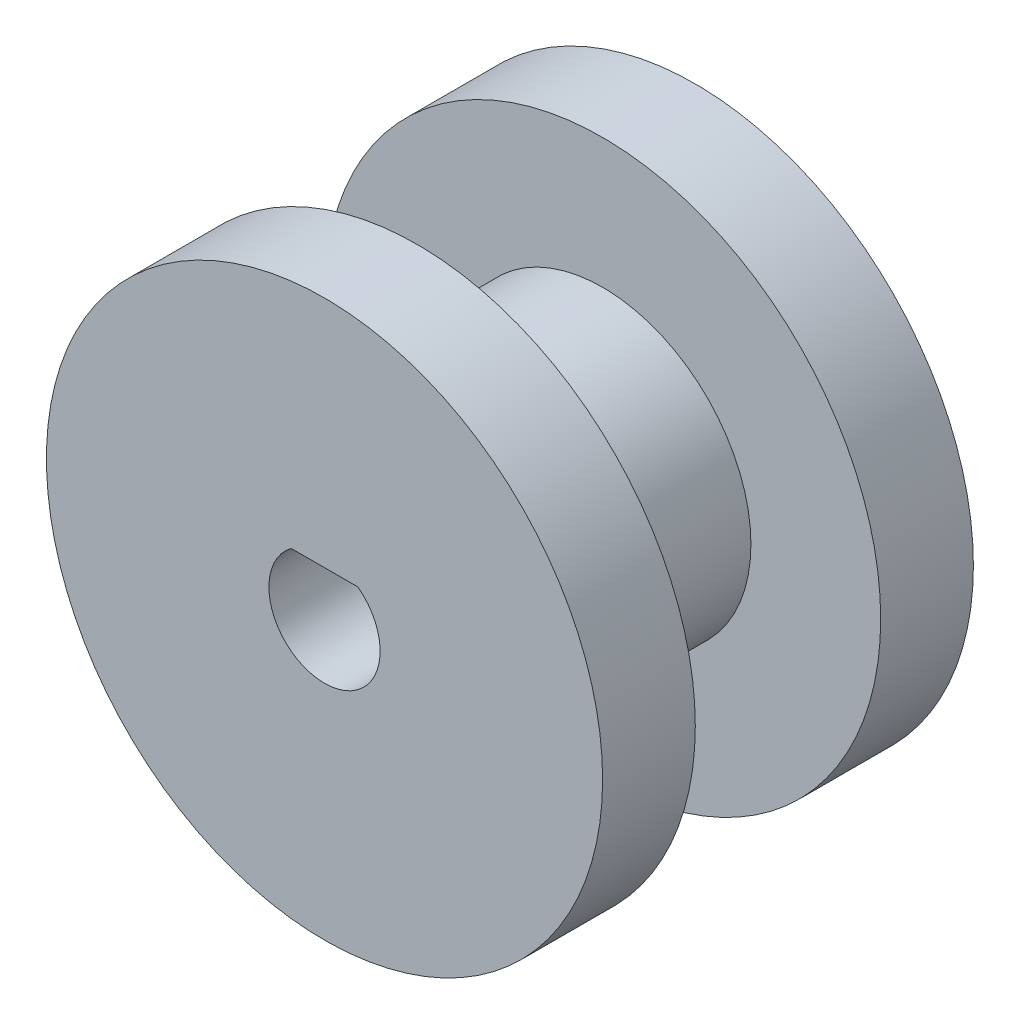
ISO-10303-21;
HEADER;
FILE_DESCRIPTION(('STEP AP214'),'2;1');
FILE_NAME('part.step','',(''),(''),'','','');
FILE_SCHEMA(('AUTOMOTIVE_DESIGN { 1 0 10303 214 1 1 1 1 }'));
ENDSEC;
DATA;
#1=APPLICATION_CONTEXT('core data for automotive mechanical design processes');
#2=APPLICATION_PROTOCOL_DEFINITION('international standard','automotive_design',2000,#1);
#3=PRODUCT_CONTEXT('',#1,'mechanical');
#4=PRODUCT('Part','Part','',(#3));
#5=PRODUCT_RELATED_PRODUCT_CATEGORY('part','',(#4));
#6=PRODUCT_DEFINITION_FORMATION('','',#4);
#7=PRODUCT_DEFINITION_CONTEXT('part definition',#1,'design');
#8=PRODUCT_DEFINITION('design','',#6,#7);
#9=PRODUCT_DEFINITION_SHAPE('','',#8);
#10=(LENGTH_UNIT() NAMED_UNIT(*) SI_UNIT(.MILLI.,.METRE.));
#11=(NAMED_UNIT(*) PLANE_ANGLE_UNIT() SI_UNIT($,.RADIAN.));
#12=(NAMED_UNIT(*) SI_UNIT($,.STERADIAN.) SOLID_ANGLE_UNIT());
#13=UNCERTAINTY_MEASURE_WITH_UNIT(LENGTH_MEASURE(1.E-05),#10,'distance_accuracy_value','');
#14=(GEOMETRIC_REPRESENTATION_CONTEXT(3) GLOBAL_UNCERTAINTY_ASSIGNED_CONTEXT((#13)) GLOBAL_UNIT_ASSIGNED_CONTEXT((#10,
#11,#12)) REPRESENTATION_CONTEXT('',''));
#15=CARTESIAN_POINT('',(0.,0.,0.));
#16=DIRECTION('',(0.,0.,1.));
#17=DIRECTION('',(1.,0.,0.));
#18=AXIS2_PLACEMENT_3D('',#15,#16,#17);
#19=CARTESIAN_POINT('',(0.,0.,5.));
#20=DIRECTION('',(0.,0.,-1.));
#21=DIRECTION('',(-1.,0.,0.));
#22=AXIS2_PLACEMENT_3D('',#19,#20,#21);
#23=CYLINDRICAL_SURFACE('',#22,3.);
#24=CARTESIAN_POINT('',(0.,0.,20.));
#25=DIRECTION('',(0.,0.,1.));
#26=DIRECTION('',(1.,0.,0.));
#27=AXIS2_PLACEMENT_3D('',#24,#25,#26);
#28=CIRCLE('',#27,3.);
#29=CARTESIAN_POINT('',(-1.8,2.4,20.));
#30=VERTEX_POINT('',#29);
#31=CARTESIAN_POINT('',(1.8,2.4,20.));
#32=VERTEX_POINT('',#31);
#33=EDGE_CURVE('E61',#30,#32,#28,.T.);
#34=ORIENTED_EDGE('',*,*,#33,.T.);
#35=DIRECTION('',(0.,0.,-1.));
#36=VECTOR('',#35,1.);
#37=CARTESIAN_POINT('',(1.8,2.4,20.));
#38=LINE('',#37,#36);
#39=CARTESIAN_POINT('',(1.8,2.4,0.));
#40=VERTEX_POINT('',#39);
#41=EDGE_CURVE('E54',#32,#40,#38,.T.);
#42=ORIENTED_EDGE('',*,*,#41,.T.);
#43=CARTESIAN_POINT('',(0.,0.,0.));
#44=DIRECTION('',(0.,0.,1.));
#45=DIRECTION('',(1.,0.,0.));
#46=AXIS2_PLACEMENT_3D('',#43,#44,#45);
#47=CIRCLE('',#46,3.);
#48=CARTESIAN_POINT('',(-1.8,2.4,0.));
#49=VERTEX_POINT('',#48);
#50=EDGE_CURVE('E49',#49,#40,#47,.T.);
#51=ORIENTED_EDGE('',*,*,#50,.F.);
#52=DIRECTION('',(0.,0.,-1.));
#53=VECTOR('',#52,1.);
#54=CARTESIAN_POINT('',(-1.8,2.4,20.));
#55=LINE('',#54,#53);
#56=EDGE_CURVE('E67',#30,#49,#55,.T.);
#57=ORIENTED_EDGE('',*,*,#56,.F.);
#58=EDGE_LOOP('',(#34,#42,#51,#57));
#59=FACE_BOUND('',#58,.T.);
#60=ADVANCED_FACE('F34',(#59),#23,.F.);
#61=CARTESIAN_POINT('',(0.,0.,5.));
#62=DIRECTION('',(0.,0.,1.));
#63=DIRECTION('',(1.,0.,0.));
#64=AXIS2_PLACEMENT_3D('',#61,#62,#63);
#65=PLANE('',#64);
#66=CARTESIAN_POINT('',(0.,0.,5.));
#67=DIRECTION('',(0.,0.,1.));
#68=DIRECTION('',(1.,0.,0.));
#69=AXIS2_PLACEMENT_3D('',#66,#67,#68);
#70=CIRCLE('',#69,15.);
#71=CARTESIAN_POINT('',(15.,0.,5.));
#72=VERTEX_POINT('',#71);
#73=EDGE_CURVE('E11',#72,#72,#70,.T.);
#74=ORIENTED_EDGE('',*,*,#73,.T.);
#75=EDGE_LOOP('',(#74));
#76=FACE_BOUND('',#75,.T.);
#77=CARTESIAN_POINT('',(0.,0.,5.));
#78=DIRECTION('',(0.,0.,1.));
#79=DIRECTION('',(1.,0.,0.));
#80=AXIS2_PLACEMENT_3D('',#77,#78,#79);
#81=CIRCLE('',#80,8.);
#82=CARTESIAN_POINT('',(8.,0.,5.));
#83=VERTEX_POINT('',#82);
#84=EDGE_CURVE('E81',#83,#83,#81,.T.);
#85=ORIENTED_EDGE('',*,*,#84,.F.);
#86=EDGE_LOOP('',(#85));
#87=FACE_BOUND('',#86,.T.);
#88=ADVANCED_FACE('F105',(#76,#87),#65,.T.);
#89=CARTESIAN_POINT('',(0.,0.,5.));
#90=DIRECTION('',(0.,0.,-1.));
#91=DIRECTION('',(-1.,0.,0.));
#92=AXIS2_PLACEMENT_3D('',#89,#90,#91);
#93=CYLINDRICAL_SURFACE('',#92,15.);
#94=ORIENTED_EDGE('',*,*,#73,.F.);
#95=EDGE_LOOP('',(#94));
#96=FACE_BOUND('',#95,.T.);
#97=CARTESIAN_POINT('',(0.,0.,0.));
#98=DIRECTION('',(0.,0.,1.));
#99=DIRECTION('',(1.,0.,0.));
#100=AXIS2_PLACEMENT_3D('',#97,#98,#99);
#101=CIRCLE('',#100,15.);
#102=CARTESIAN_POINT('',(15.,0.,0.));
#103=VERTEX_POINT('',#102);
#104=EDGE_CURVE('E37',#103,#103,#101,.T.);
#105=ORIENTED_EDGE('',*,*,#104,.T.);
#106=EDGE_LOOP('',(#105));
#107=FACE_BOUND('',#106,.T.);
#108=ADVANCED_FACE('F92',(#96,#107),#93,.T.);
#109=CARTESIAN_POINT('',(0.,0.,0.));
#110=DIRECTION('',(0.,0.,1.));
#111=DIRECTION('',(1.,0.,0.));
#112=AXIS2_PLACEMENT_3D('',#109,#110,#111);
#113=PLANE('',#112);
#114=ORIENTED_EDGE('',*,*,#50,.T.);
#115=DIRECTION('',(1.,0.,0.));
#116=VECTOR('',#115,1.);
#117=CARTESIAN_POINT('',(0.,2.4,0.));
#118=LINE('',#117,#116);
#119=EDGE_CURVE('E73',#49,#40,#118,.T.);
#120=ORIENTED_EDGE('',*,*,#119,.F.);
#121=EDGE_LOOP('',(#114,#120));
#122=FACE_BOUND('',#121,.T.);
#123=ORIENTED_EDGE('',*,*,#104,.F.);
#124=EDGE_LOOP('',(#123));
#125=FACE_BOUND('',#124,.T.);
#126=ADVANCED_FACE('F94',(#122,#125),#113,.F.);
#127=CARTESIAN_POINT('',(0.,0.,15.));
#128=DIRECTION('',(0.,0.,-1.));
#129=DIRECTION('',(-1.,0.,0.));
#130=AXIS2_PLACEMENT_3D('',#127,#128,#129);
#131=CYLINDRICAL_SURFACE('',#130,8.);
#132=CARTESIAN_POINT('',(0.,0.,15.));
#133=DIRECTION('',(0.,0.,1.));
#134=DIRECTION('',(1.,0.,0.));
#135=AXIS2_PLACEMENT_3D('',#132,#133,#134);
#136=CIRCLE('',#135,8.);
#137=CARTESIAN_POINT('',(8.,0.,15.));
#138=VERTEX_POINT('',#137);
#139=EDGE_CURVE('E84',#138,#138,#136,.T.);
#140=ORIENTED_EDGE('',*,*,#139,.F.);
#141=EDGE_LOOP('',(#140));
#142=FACE_BOUND('',#141,.T.);
#143=ORIENTED_EDGE('',*,*,#84,.T.);
#144=EDGE_LOOP('',(#143));
#145=FACE_BOUND('',#144,.T.);
#146=ADVANCED_FACE('F96',(#142,#145),#131,.T.);
#147=CARTESIAN_POINT('',(0.,0.,15.));
#148=DIRECTION('',(0.,0.,1.));
#149=DIRECTION('',(1.,0.,0.));
#150=AXIS2_PLACEMENT_3D('',#147,#148,#149);
#151=PLANE('',#150);
#152=CARTESIAN_POINT('',(0.,0.,15.));
#153=DIRECTION('',(0.,0.,1.));
#154=DIRECTION('',(1.,0.,0.));
#155=AXIS2_PLACEMENT_3D('',#152,#153,#154);
#156=CIRCLE('',#155,15.);
#157=CARTESIAN_POINT('',(15.,0.,15.));
#158=VERTEX_POINT('',#157);
#159=EDGE_CURVE('E65',#158,#158,#156,.T.);
#160=ORIENTED_EDGE('',*,*,#159,.F.);
#161=EDGE_LOOP('',(#160));
#162=FACE_BOUND('',#161,.T.);
#163=ORIENTED_EDGE('',*,*,#139,.T.);
#164=EDGE_LOOP('',(#163));
#165=FACE_BOUND('',#164,.T.);
#166=ADVANCED_FACE('F102',(#162,#165),#151,.F.);
#167=CARTESIAN_POINT('',(0.,0.,20.));
#168=DIRECTION('',(0.,0.,1.));
#169=DIRECTION('',(1.,0.,0.));
#170=AXIS2_PLACEMENT_3D('',#167,#168,#169);
#171=PLANE('',#170);
#172=CARTESIAN_POINT('',(0.,0.,20.));
#173=DIRECTION('',(0.,0.,1.));
#174=DIRECTION('',(1.,0.,0.));
#175=AXIS2_PLACEMENT_3D('',#172,#173,#174);
#176=CIRCLE('',#175,15.);
#177=CARTESIAN_POINT('',(15.,0.,20.));
#178=VERTEX_POINT('',#177);
#179=EDGE_CURVE('E78',#178,#178,#176,.T.);
#180=ORIENTED_EDGE('',*,*,#179,.T.);
#181=EDGE_LOOP('',(#180));
#182=FACE_BOUND('',#181,.T.);
#183=ORIENTED_EDGE('',*,*,#33,.F.);
#184=DIRECTION('',(1.,0.,0.));
#185=VECTOR('',#184,1.);
#186=CARTESIAN_POINT('',(0.,2.4,20.));
#187=LINE('',#186,#185);
#188=EDGE_CURVE('E64',#30,#32,#187,.T.);
#189=ORIENTED_EDGE('',*,*,#188,.T.);
#190=EDGE_LOOP('',(#183,#189));
#191=FACE_BOUND('',#190,.T.);
#192=ADVANCED_FACE('F62',(#182,#191),#171,.T.);
#193=CARTESIAN_POINT('',(0.,0.,20.));
#194=DIRECTION('',(0.,0.,-1.));
#195=DIRECTION('',(-1.,0.,0.));
#196=AXIS2_PLACEMENT_3D('',#193,#194,#195);
#197=CYLINDRICAL_SURFACE('',#196,15.);
#198=ORIENTED_EDGE('',*,*,#179,.F.);
#199=EDGE_LOOP('',(#198));
#200=FACE_BOUND('',#199,.T.);
#201=ORIENTED_EDGE('',*,*,#159,.T.);
#202=EDGE_LOOP('',(#201));
#203=FACE_BOUND('',#202,.T.);
#204=ADVANCED_FACE('F117',(#200,#203),#197,.T.);
#205=CARTESIAN_POINT('',(0.,2.4,20.));
#206=DIRECTION('',(0.,1.,0.));
#207=DIRECTION('',(0.,0.,1.));
#208=AXIS2_PLACEMENT_3D('',#205,#206,#207);
#209=PLANE('',#208);
#210=ORIENTED_EDGE('',*,*,#119,.T.);
#211=ORIENTED_EDGE('',*,*,#41,.F.);
#212=ORIENTED_EDGE('',*,*,#188,.F.);
#213=ORIENTED_EDGE('',*,*,#56,.T.);
#214=EDGE_LOOP('',(#210,#211,#212,#213));
#215=FACE_BOUND('',#214,.T.);
#216=ADVANCED_FACE('F72',(#215),#209,.F.);
#217=CLOSED_SHELL('',(#60,#88,#108,#126,#146,#166,#192,#204,#216));
#218=MANIFOLD_SOLID_BREP('B2',#217);
#219=ADVANCED_BREP_SHAPE_REPRESENTATION('',(#18,#218),#14);
#220=SHAPE_DEFINITION_REPRESENTATION(#9,#219);
ENDSEC;
END-ISO-10303-21;
